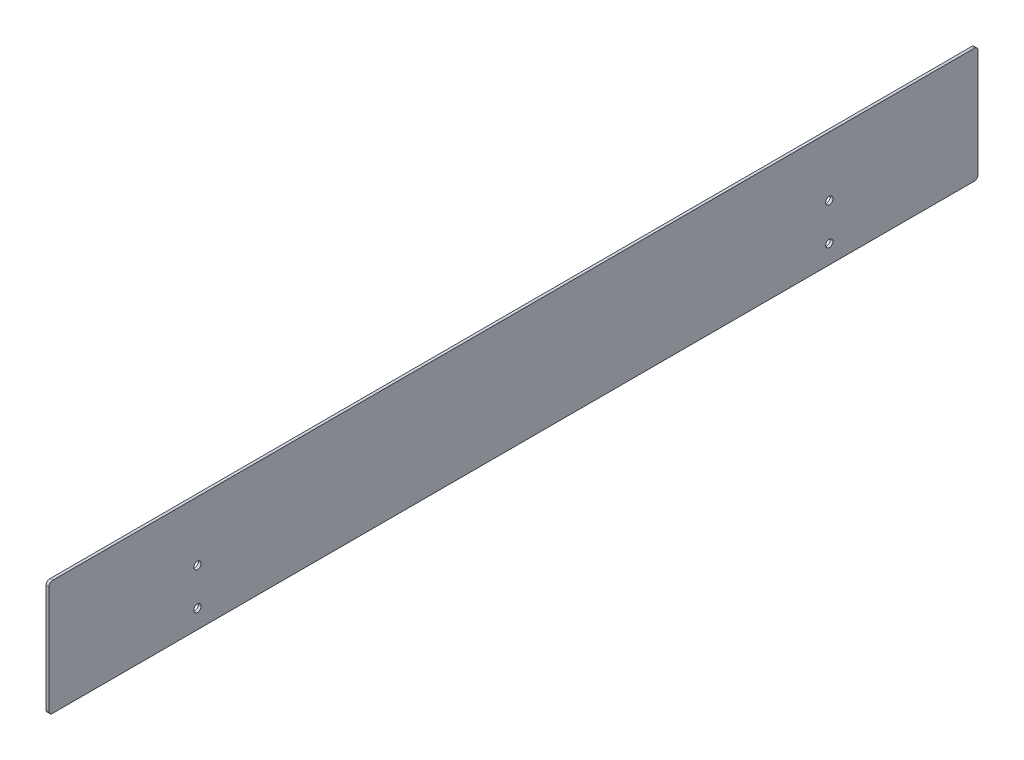
ISO-10303-21;
HEADER;
FILE_DESCRIPTION(('STEP AP214'),'2;1');
FILE_NAME('part.step','',(''),(''),'','','');
FILE_SCHEMA(('AUTOMOTIVE_DESIGN { 1 0 10303 214 1 1 1 1 }'));
ENDSEC;
DATA;
#1=APPLICATION_CONTEXT('core data for automotive mechanical design processes');
#2=APPLICATION_PROTOCOL_DEFINITION('international standard','automotive_design',2000,#1);
#3=PRODUCT_CONTEXT('',#1,'mechanical');
#4=PRODUCT('Part','Part','',(#3));
#5=PRODUCT_RELATED_PRODUCT_CATEGORY('part','',(#4));
#6=PRODUCT_DEFINITION_FORMATION('','',#4);
#7=PRODUCT_DEFINITION_CONTEXT('part definition',#1,'design');
#8=PRODUCT_DEFINITION('design','',#6,#7);
#9=PRODUCT_DEFINITION_SHAPE('','',#8);
#10=(LENGTH_UNIT() NAMED_UNIT(*) SI_UNIT(.MILLI.,.METRE.));
#11=(NAMED_UNIT(*) PLANE_ANGLE_UNIT() SI_UNIT($,.RADIAN.));
#12=(NAMED_UNIT(*) SI_UNIT($,.STERADIAN.) SOLID_ANGLE_UNIT());
#13=UNCERTAINTY_MEASURE_WITH_UNIT(LENGTH_MEASURE(1.E-05),#10,'distance_accuracy_value','');
#14=(GEOMETRIC_REPRESENTATION_CONTEXT(3) GLOBAL_UNCERTAINTY_ASSIGNED_CONTEXT((#13)) GLOBAL_UNIT_ASSIGNED_CONTEXT((#10,
#11,#12)) REPRESENTATION_CONTEXT('',''));
#15=CARTESIAN_POINT('',(0.,0.,0.));
#16=DIRECTION('',(0.,0.,1.));
#17=DIRECTION('',(1.,0.,0.));
#18=AXIS2_PLACEMENT_3D('',#15,#16,#17);
#19=CARTESIAN_POINT('',(1.5,0.,0.));
#20=DIRECTION('',(1.,0.,0.));
#21=DIRECTION('',(0.,0.,-1.));
#22=AXIS2_PLACEMENT_3D('',#19,#20,#21);
#23=PLANE('',#22);
#24=CARTESIAN_POINT('',(1.5,-110.292553191489,181.339345362168));
#25=DIRECTION('',(1.,0.,0.));
#26=DIRECTION('',(0.,0.,-1.));
#27=AXIS2_PLACEMENT_3D('',#24,#25,#26);
#28=CIRCLE('',#27,1.95);
#29=CARTESIAN_POINT('',(1.5,-110.292553191489,179.389345362168));
#30=VERTEX_POINT('',#29);
#31=EDGE_CURVE('E180',#30,#30,#28,.T.);
#32=ORIENTED_EDGE('',*,*,#31,.F.);
#33=EDGE_LOOP('',(#32));
#34=FACE_BOUND('',#33,.T.);
#35=CARTESIAN_POINT('',(1.5,-110.292553191489,-158.660654637832));
#36=DIRECTION('',(1.,0.,0.));
#37=DIRECTION('',(0.,0.,-1.));
#38=AXIS2_PLACEMENT_3D('',#35,#36,#37);
#39=CIRCLE('',#38,1.95);
#40=CARTESIAN_POINT('',(1.5,-110.292553191489,-160.610654637832));
#41=VERTEX_POINT('',#40);
#42=EDGE_CURVE('E163',#41,#41,#39,.T.);
#43=ORIENTED_EDGE('',*,*,#42,.F.);
#44=EDGE_LOOP('',(#43));
#45=FACE_BOUND('',#44,.T.);
#46=DIRECTION('',(0.,0.,-1.));
#47=VECTOR('',#46,1.);
#48=CARTESIAN_POINT('',(1.5,-140.292553191489,261.339345362168));
#49=LINE('',#48,#47);
#50=CARTESIAN_POINT('',(1.5,-140.292553191489,259.339345362168));
#51=VERTEX_POINT('',#50);
#52=CARTESIAN_POINT('',(1.5,-140.292553191489,-236.660654637832));
#53=VERTEX_POINT('',#52);
#54=EDGE_CURVE('E170',#51,#53,#49,.T.);
#55=ORIENTED_EDGE('',*,*,#54,.T.);
#56=CARTESIAN_POINT('',(1.5,-138.292553191489,-236.660654637832));
#57=DIRECTION('',(1.,0.,0.));
#58=DIRECTION('',(0.,0.,-1.));
#59=AXIS2_PLACEMENT_3D('',#56,#57,#58);
#60=CIRCLE('',#59,2.);
#61=CARTESIAN_POINT('',(1.5,-138.292553191489,-238.660654637832));
#62=VERTEX_POINT('',#61);
#63=EDGE_CURVE('E147',#53,#62,#60,.T.);
#64=ORIENTED_EDGE('',*,*,#63,.T.);
#65=DIRECTION('',(0.,1.,0.));
#66=VECTOR('',#65,1.);
#67=CARTESIAN_POINT('',(1.5,-78.2925531914894,-238.660654637832));
#68=LINE('',#67,#66);
#69=CARTESIAN_POINT('',(1.5,-80.2925531914894,-238.660654637832));
#70=VERTEX_POINT('',#69);
#71=EDGE_CURVE('E117',#62,#70,#68,.T.);
#72=ORIENTED_EDGE('',*,*,#71,.T.);
#73=CARTESIAN_POINT('',(1.5,-80.2925531914894,-236.660654637832));
#74=DIRECTION('',(1.,0.,0.));
#75=DIRECTION('',(0.,0.,-1.));
#76=AXIS2_PLACEMENT_3D('',#73,#74,#75);
#77=CIRCLE('',#76,2.);
#78=CARTESIAN_POINT('',(1.5,-78.2925531914894,-236.660654637832));
#79=VERTEX_POINT('',#78);
#80=EDGE_CURVE('E54',#70,#79,#77,.T.);
#81=ORIENTED_EDGE('',*,*,#80,.T.);
#82=DIRECTION('',(0.,0.,1.));
#83=VECTOR('',#82,1.);
#84=CARTESIAN_POINT('',(1.5,-78.2925531914894,261.339345362168));
#85=LINE('',#84,#83);
#86=CARTESIAN_POINT('',(1.5,-78.2925531914894,259.339345362168));
#87=VERTEX_POINT('',#86);
#88=EDGE_CURVE('E133',#79,#87,#85,.T.);
#89=ORIENTED_EDGE('',*,*,#88,.T.);
#90=CARTESIAN_POINT('',(1.5,-80.2925531914894,259.339345362168));
#91=DIRECTION('',(1.,0.,0.));
#92=DIRECTION('',(0.,0.,-1.));
#93=AXIS2_PLACEMENT_3D('',#90,#91,#92);
#94=CIRCLE('',#93,2.);
#95=CARTESIAN_POINT('',(1.5,-80.2925531914894,261.339345362168));
#96=VERTEX_POINT('',#95);
#97=EDGE_CURVE('E142',#87,#96,#94,.T.);
#98=ORIENTED_EDGE('',*,*,#97,.T.);
#99=DIRECTION('',(0.,-1.,0.));
#100=VECTOR('',#99,1.);
#101=CARTESIAN_POINT('',(1.5,-78.2925531914894,261.339345362168));
#102=LINE('',#101,#100);
#103=CARTESIAN_POINT('',(1.5,-138.292553191489,261.339345362168));
#104=VERTEX_POINT('',#103);
#105=EDGE_CURVE('E127',#96,#104,#102,.T.);
#106=ORIENTED_EDGE('',*,*,#105,.T.);
#107=CARTESIAN_POINT('',(1.5,-138.292553191489,259.339345362168));
#108=DIRECTION('',(1.,0.,0.));
#109=DIRECTION('',(0.,0.,-1.));
#110=AXIS2_PLACEMENT_3D('',#107,#108,#109);
#111=CIRCLE('',#110,2.);
#112=EDGE_CURVE('E144',#104,#51,#111,.T.);
#113=ORIENTED_EDGE('',*,*,#112,.T.);
#114=EDGE_LOOP('',(#55,#64,#72,#81,#89,#98,#106,#113));
#115=FACE_BOUND('',#114,.T.);
#116=CARTESIAN_POINT('',(1.5,-130.292553191489,-158.660654637832));
#117=DIRECTION('',(1.,0.,0.));
#118=DIRECTION('',(0.,0.,-1.));
#119=AXIS2_PLACEMENT_3D('',#116,#117,#118);
#120=CIRCLE('',#119,1.95);
#121=CARTESIAN_POINT('',(1.5,-130.292553191489,-160.610654637832));
#122=VERTEX_POINT('',#121);
#123=EDGE_CURVE('E175',#122,#122,#120,.T.);
#124=ORIENTED_EDGE('',*,*,#123,.F.);
#125=EDGE_LOOP('',(#124));
#126=FACE_BOUND('',#125,.T.);
#127=CARTESIAN_POINT('',(1.5,-130.292553191489,181.339345362168));
#128=DIRECTION('',(1.,0.,0.));
#129=DIRECTION('',(0.,0.,-1.));
#130=AXIS2_PLACEMENT_3D('',#127,#128,#129);
#131=CIRCLE('',#130,1.95);
#132=CARTESIAN_POINT('',(1.5,-130.292553191489,179.389345362168));
#133=VERTEX_POINT('',#132);
#134=EDGE_CURVE('E186',#133,#133,#131,.T.);
#135=ORIENTED_EDGE('',*,*,#134,.F.);
#136=EDGE_LOOP('',(#135));
#137=FACE_BOUND('',#136,.T.);
#138=ADVANCED_FACE('F32',(#34,#45,#115,#126,#137),#23,.T.);
#139=CARTESIAN_POINT('',(0.,0.,0.));
#140=DIRECTION('',(1.,0.,0.));
#141=DIRECTION('',(0.,0.,-1.));
#142=AXIS2_PLACEMENT_3D('',#139,#140,#141);
#143=PLANE('',#142);
#144=DIRECTION('',(0.,1.,0.));
#145=VECTOR('',#144,1.);
#146=CARTESIAN_POINT('',(0.,-78.2925531914894,-238.660654637832));
#147=LINE('',#146,#145);
#148=CARTESIAN_POINT('',(0.,-138.292553191489,-238.660654637832));
#149=VERTEX_POINT('',#148);
#150=CARTESIAN_POINT('',(0.,-80.2925531914894,-238.660654637832));
#151=VERTEX_POINT('',#150);
#152=EDGE_CURVE('E115',#149,#151,#147,.T.);
#153=ORIENTED_EDGE('',*,*,#152,.F.);
#154=CARTESIAN_POINT('',(0.,-138.292553191489,-236.660654637832));
#155=DIRECTION('',(1.,0.,0.));
#156=DIRECTION('',(0.,0.,-1.));
#157=AXIS2_PLACEMENT_3D('',#154,#155,#156);
#158=CIRCLE('',#157,2.);
#159=CARTESIAN_POINT('',(0.,-140.292553191489,-236.660654637832));
#160=VERTEX_POINT('',#159);
#161=EDGE_CURVE('E98',#149,#160,#158,.F.);
#162=ORIENTED_EDGE('',*,*,#161,.T.);
#163=DIRECTION('',(0.,0.,-1.));
#164=VECTOR('',#163,1.);
#165=CARTESIAN_POINT('',(0.,-140.292553191489,261.339345362168));
#166=LINE('',#165,#164);
#167=CARTESIAN_POINT('',(0.,-140.292553191489,259.339345362168));
#168=VERTEX_POINT('',#167);
#169=EDGE_CURVE('E125',#168,#160,#166,.T.);
#170=ORIENTED_EDGE('',*,*,#169,.F.);
#171=CARTESIAN_POINT('',(0.,-138.292553191489,259.339345362168));
#172=DIRECTION('',(1.,0.,0.));
#173=DIRECTION('',(0.,0.,-1.));
#174=AXIS2_PLACEMENT_3D('',#171,#172,#173);
#175=CIRCLE('',#174,2.);
#176=CARTESIAN_POINT('',(0.,-138.292553191489,261.339345362168));
#177=VERTEX_POINT('',#176);
#178=EDGE_CURVE('E136',#168,#177,#175,.F.);
#179=ORIENTED_EDGE('',*,*,#178,.T.);
#180=DIRECTION('',(0.,-1.,0.));
#181=VECTOR('',#180,1.);
#182=CARTESIAN_POINT('',(0.,-78.2925531914894,261.339345362168));
#183=LINE('',#182,#181);
#184=CARTESIAN_POINT('',(0.,-80.2925531914894,261.339345362168));
#185=VERTEX_POINT('',#184);
#186=EDGE_CURVE('E129',#185,#177,#183,.T.);
#187=ORIENTED_EDGE('',*,*,#186,.F.);
#188=CARTESIAN_POINT('',(0.,-80.2925531914894,259.339345362168));
#189=DIRECTION('',(1.,0.,0.));
#190=DIRECTION('',(0.,0.,-1.));
#191=AXIS2_PLACEMENT_3D('',#188,#189,#190);
#192=CIRCLE('',#191,2.);
#193=CARTESIAN_POINT('',(0.,-78.2925531914894,259.339345362168));
#194=VERTEX_POINT('',#193);
#195=EDGE_CURVE('E118',#185,#194,#192,.F.);
#196=ORIENTED_EDGE('',*,*,#195,.T.);
#197=DIRECTION('',(0.,0.,1.));
#198=VECTOR('',#197,1.);
#199=CARTESIAN_POINT('',(0.,-78.2925531914894,261.339345362168));
#200=LINE('',#199,#198);
#201=CARTESIAN_POINT('',(0.,-78.2925531914894,-236.660654637832));
#202=VERTEX_POINT('',#201);
#203=EDGE_CURVE('E124',#202,#194,#200,.T.);
#204=ORIENTED_EDGE('',*,*,#203,.F.);
#205=CARTESIAN_POINT('',(0.,-80.2925531914894,-236.660654637832));
#206=DIRECTION('',(1.,0.,0.));
#207=DIRECTION('',(0.,0.,-1.));
#208=AXIS2_PLACEMENT_3D('',#205,#206,#207);
#209=CIRCLE('',#208,2.);
#210=EDGE_CURVE('E109',#202,#151,#209,.F.);
#211=ORIENTED_EDGE('',*,*,#210,.T.);
#212=EDGE_LOOP('',(#153,#162,#170,#179,#187,#196,#204,#211));
#213=FACE_BOUND('',#212,.T.);
#214=CARTESIAN_POINT('',(0.,-110.292553191489,-158.660654637832));
#215=DIRECTION('',(1.,0.,0.));
#216=DIRECTION('',(0.,0.,-1.));
#217=AXIS2_PLACEMENT_3D('',#214,#215,#216);
#218=CIRCLE('',#217,1.95);
#219=CARTESIAN_POINT('',(0.,-110.292553191489,-160.610654637832));
#220=VERTEX_POINT('',#219);
#221=EDGE_CURVE('E165',#220,#220,#218,.T.);
#222=ORIENTED_EDGE('',*,*,#221,.T.);
#223=EDGE_LOOP('',(#222));
#224=FACE_BOUND('',#223,.T.);
#225=CARTESIAN_POINT('',(0.,-130.292553191489,-158.660654637832));
#226=DIRECTION('',(1.,0.,0.));
#227=DIRECTION('',(0.,0.,-1.));
#228=AXIS2_PLACEMENT_3D('',#225,#226,#227);
#229=CIRCLE('',#228,1.95);
#230=CARTESIAN_POINT('',(0.,-130.292553191489,-160.610654637832));
#231=VERTEX_POINT('',#230);
#232=EDGE_CURVE('E177',#231,#231,#229,.T.);
#233=ORIENTED_EDGE('',*,*,#232,.T.);
#234=EDGE_LOOP('',(#233));
#235=FACE_BOUND('',#234,.T.);
#236=CARTESIAN_POINT('',(0.,-110.292553191489,181.339345362168));
#237=DIRECTION('',(1.,0.,0.));
#238=DIRECTION('',(0.,0.,-1.));
#239=AXIS2_PLACEMENT_3D('',#236,#237,#238);
#240=CIRCLE('',#239,1.95);
#241=CARTESIAN_POINT('',(0.,-110.292553191489,179.389345362168));
#242=VERTEX_POINT('',#241);
#243=EDGE_CURVE('E183',#242,#242,#240,.T.);
#244=ORIENTED_EDGE('',*,*,#243,.T.);
#245=EDGE_LOOP('',(#244));
#246=FACE_BOUND('',#245,.T.);
#247=CARTESIAN_POINT('',(0.,-130.292553191489,181.339345362168));
#248=DIRECTION('',(1.,0.,0.));
#249=DIRECTION('',(0.,0.,-1.));
#250=AXIS2_PLACEMENT_3D('',#247,#248,#249);
#251=CIRCLE('',#250,1.95);
#252=CARTESIAN_POINT('',(0.,-130.292553191489,179.389345362168));
#253=VERTEX_POINT('',#252);
#254=EDGE_CURVE('E189',#253,#253,#251,.T.);
#255=ORIENTED_EDGE('',*,*,#254,.T.);
#256=EDGE_LOOP('',(#255));
#257=FACE_BOUND('',#256,.T.);
#258=ADVANCED_FACE('F121',(#213,#224,#235,#246,#257),#143,.F.);
#259=CARTESIAN_POINT('',(1.5,-78.2925531914894,261.339345362168));
#260=DIRECTION('',(0.,0.,-1.));
#261=DIRECTION('',(0.,1.,0.));
#262=AXIS2_PLACEMENT_3D('',#259,#260,#261);
#263=PLANE('',#262);
#264=ORIENTED_EDGE('',*,*,#186,.T.);
#265=DIRECTION('',(-1.,0.,0.));
#266=VECTOR('',#265,1.);
#267=CARTESIAN_POINT('',(1.5,-138.292553191489,261.339345362168));
#268=LINE('',#267,#266);
#269=EDGE_CURVE('E11',#177,#104,#268,.F.);
#270=ORIENTED_EDGE('',*,*,#269,.T.);
#271=ORIENTED_EDGE('',*,*,#105,.F.);
#272=DIRECTION('',(-1.,0.,0.));
#273=VECTOR('',#272,1.);
#274=CARTESIAN_POINT('',(1.5,-80.2925531914894,261.339345362168));
#275=LINE('',#274,#273);
#276=EDGE_CURVE('E40',#96,#185,#275,.T.);
#277=ORIENTED_EDGE('',*,*,#276,.T.);
#278=EDGE_LOOP('',(#264,#270,#271,#277));
#279=FACE_BOUND('',#278,.T.);
#280=ADVANCED_FACE('F158',(#279),#263,.F.);
#281=CARTESIAN_POINT('',(1.5,-140.292553191489,261.339345362168));
#282=DIRECTION('',(0.,1.,0.));
#283=DIRECTION('',(0.,0.,1.));
#284=AXIS2_PLACEMENT_3D('',#281,#282,#283);
#285=PLANE('',#284);
#286=ORIENTED_EDGE('',*,*,#169,.T.);
#287=DIRECTION('',(-1.,0.,0.));
#288=VECTOR('',#287,1.);
#289=CARTESIAN_POINT('',(1.5,-140.292553191489,-236.660654637832));
#290=LINE('',#289,#288);
#291=EDGE_CURVE('E103',#160,#53,#290,.F.);
#292=ORIENTED_EDGE('',*,*,#291,.T.);
#293=ORIENTED_EDGE('',*,*,#54,.F.);
#294=DIRECTION('',(-1.,0.,0.));
#295=VECTOR('',#294,1.);
#296=CARTESIAN_POINT('',(1.5,-140.292553191489,259.339345362168));
#297=LINE('',#296,#295);
#298=EDGE_CURVE('E108',#51,#168,#297,.T.);
#299=ORIENTED_EDGE('',*,*,#298,.T.);
#300=EDGE_LOOP('',(#286,#292,#293,#299));
#301=FACE_BOUND('',#300,.T.);
#302=ADVANCED_FACE('F216',(#301),#285,.F.);
#303=CARTESIAN_POINT('',(1.5,-78.2925531914894,-238.660654637832));
#304=DIRECTION('',(0.,0.,1.));
#305=DIRECTION('',(0.,-1.,0.));
#306=AXIS2_PLACEMENT_3D('',#303,#304,#305);
#307=PLANE('',#306);
#308=ORIENTED_EDGE('',*,*,#71,.F.);
#309=DIRECTION('',(-1.,0.,0.));
#310=VECTOR('',#309,1.);
#311=CARTESIAN_POINT('',(1.5,-138.292553191489,-238.660654637832));
#312=LINE('',#311,#310);
#313=EDGE_CURVE('E102',#62,#149,#312,.T.);
#314=ORIENTED_EDGE('',*,*,#313,.T.);
#315=ORIENTED_EDGE('',*,*,#152,.T.);
#316=DIRECTION('',(-1.,0.,0.));
#317=VECTOR('',#316,1.);
#318=CARTESIAN_POINT('',(1.5,-80.2925531914894,-238.660654637832));
#319=LINE('',#318,#317);
#320=EDGE_CURVE('E119',#151,#70,#319,.F.);
#321=ORIENTED_EDGE('',*,*,#320,.T.);
#322=EDGE_LOOP('',(#308,#314,#315,#321));
#323=FACE_BOUND('',#322,.T.);
#324=ADVANCED_FACE('F114',(#323),#307,.F.);
#325=CARTESIAN_POINT('',(1.5,-78.2925531914894,261.339345362168));
#326=DIRECTION('',(0.,-1.,0.));
#327=DIRECTION('',(0.,0.,-1.));
#328=AXIS2_PLACEMENT_3D('',#325,#326,#327);
#329=PLANE('',#328);
#330=ORIENTED_EDGE('',*,*,#88,.F.);
#331=DIRECTION('',(-1.,0.,0.));
#332=VECTOR('',#331,1.);
#333=CARTESIAN_POINT('',(1.5,-78.2925531914894,-236.660654637832));
#334=LINE('',#333,#332);
#335=EDGE_CURVE('E150',#79,#202,#334,.T.);
#336=ORIENTED_EDGE('',*,*,#335,.T.);
#337=ORIENTED_EDGE('',*,*,#203,.T.);
#338=DIRECTION('',(-1.,0.,0.));
#339=VECTOR('',#338,1.);
#340=CARTESIAN_POINT('',(1.5,-78.2925531914894,259.339345362168));
#341=LINE('',#340,#339);
#342=EDGE_CURVE('E47',#194,#87,#341,.F.);
#343=ORIENTED_EDGE('',*,*,#342,.T.);
#344=EDGE_LOOP('',(#330,#336,#337,#343));
#345=FACE_BOUND('',#344,.T.);
#346=ADVANCED_FACE('F211',(#345),#329,.F.);
#347=CARTESIAN_POINT('',(1.5,-110.292553191489,-158.660654637832));
#348=DIRECTION('',(-1.,0.,0.));
#349=DIRECTION('',(0.,0.,1.));
#350=AXIS2_PLACEMENT_3D('',#347,#348,#349);
#351=CYLINDRICAL_SURFACE('',#350,1.95);
#352=ORIENTED_EDGE('',*,*,#42,.T.);
#353=EDGE_LOOP('',(#352));
#354=FACE_BOUND('',#353,.T.);
#355=ORIENTED_EDGE('',*,*,#221,.F.);
#356=EDGE_LOOP('',(#355));
#357=FACE_BOUND('',#356,.T.);
#358=ADVANCED_FACE('F208',(#354,#357),#351,.F.);
#359=CARTESIAN_POINT('',(1.5,-130.292553191489,-158.660654637832));
#360=DIRECTION('',(-1.,0.,0.));
#361=DIRECTION('',(0.,0.,1.));
#362=AXIS2_PLACEMENT_3D('',#359,#360,#361);
#363=CYLINDRICAL_SURFACE('',#362,1.95);
#364=ORIENTED_EDGE('',*,*,#123,.T.);
#365=EDGE_LOOP('',(#364));
#366=FACE_BOUND('',#365,.T.);
#367=ORIENTED_EDGE('',*,*,#232,.F.);
#368=EDGE_LOOP('',(#367));
#369=FACE_BOUND('',#368,.T.);
#370=ADVANCED_FACE('F240',(#366,#369),#363,.F.);
#371=CARTESIAN_POINT('',(1.5,-110.292553191489,181.339345362168));
#372=DIRECTION('',(-1.,0.,0.));
#373=DIRECTION('',(0.,0.,1.));
#374=AXIS2_PLACEMENT_3D('',#371,#372,#373);
#375=CYLINDRICAL_SURFACE('',#374,1.95);
#376=ORIENTED_EDGE('',*,*,#31,.T.);
#377=EDGE_LOOP('',(#376));
#378=FACE_BOUND('',#377,.T.);
#379=ORIENTED_EDGE('',*,*,#243,.F.);
#380=EDGE_LOOP('',(#379));
#381=FACE_BOUND('',#380,.T.);
#382=ADVANCED_FACE('F243',(#378,#381),#375,.F.);
#383=CARTESIAN_POINT('',(1.5,-130.292553191489,181.339345362168));
#384=DIRECTION('',(-1.,0.,0.));
#385=DIRECTION('',(0.,0.,1.));
#386=AXIS2_PLACEMENT_3D('',#383,#384,#385);
#387=CYLINDRICAL_SURFACE('',#386,1.95);
#388=ORIENTED_EDGE('',*,*,#134,.T.);
#389=EDGE_LOOP('',(#388));
#390=FACE_BOUND('',#389,.T.);
#391=ORIENTED_EDGE('',*,*,#254,.F.);
#392=EDGE_LOOP('',(#391));
#393=FACE_BOUND('',#392,.T.);
#394=ADVANCED_FACE('F195',(#390,#393),#387,.F.);
#395=CARTESIAN_POINT('',(1.5,-138.292553191489,-236.660654637832));
#396=DIRECTION('',(-1.,0.,0.));
#397=DIRECTION('',(0.,0.,1.));
#398=AXIS2_PLACEMENT_3D('',#395,#396,#397);
#399=CYLINDRICAL_SURFACE('',#398,2.);
#400=ORIENTED_EDGE('',*,*,#63,.F.);
#401=ORIENTED_EDGE('',*,*,#291,.F.);
#402=ORIENTED_EDGE('',*,*,#161,.F.);
#403=ORIENTED_EDGE('',*,*,#313,.F.);
#404=EDGE_LOOP('',(#400,#401,#402,#403));
#405=FACE_BOUND('',#404,.T.);
#406=ADVANCED_FACE('F101',(#405),#399,.T.);
#407=CARTESIAN_POINT('',(1.5,-80.2925531914894,-236.660654637832));
#408=DIRECTION('',(-1.,0.,0.));
#409=DIRECTION('',(0.,0.,1.));
#410=AXIS2_PLACEMENT_3D('',#407,#408,#409);
#411=CYLINDRICAL_SURFACE('',#410,2.);
#412=ORIENTED_EDGE('',*,*,#80,.F.);
#413=ORIENTED_EDGE('',*,*,#320,.F.);
#414=ORIENTED_EDGE('',*,*,#210,.F.);
#415=ORIENTED_EDGE('',*,*,#335,.F.);
#416=EDGE_LOOP('',(#412,#413,#414,#415));
#417=FACE_BOUND('',#416,.T.);
#418=ADVANCED_FACE('F224',(#417),#411,.T.);
#419=CARTESIAN_POINT('',(1.5,-138.292553191489,259.339345362168));
#420=DIRECTION('',(-1.,0.,0.));
#421=DIRECTION('',(0.,0.,1.));
#422=AXIS2_PLACEMENT_3D('',#419,#420,#421);
#423=CYLINDRICAL_SURFACE('',#422,2.);
#424=ORIENTED_EDGE('',*,*,#112,.F.);
#425=ORIENTED_EDGE('',*,*,#269,.F.);
#426=ORIENTED_EDGE('',*,*,#178,.F.);
#427=ORIENTED_EDGE('',*,*,#298,.F.);
#428=EDGE_LOOP('',(#424,#425,#426,#427));
#429=FACE_BOUND('',#428,.T.);
#430=ADVANCED_FACE('F226',(#429),#423,.T.);
#431=CARTESIAN_POINT('',(1.5,-80.2925531914894,259.339345362168));
#432=DIRECTION('',(-1.,0.,0.));
#433=DIRECTION('',(0.,0.,1.));
#434=AXIS2_PLACEMENT_3D('',#431,#432,#433);
#435=CYLINDRICAL_SURFACE('',#434,2.);
#436=ORIENTED_EDGE('',*,*,#97,.F.);
#437=ORIENTED_EDGE('',*,*,#342,.F.);
#438=ORIENTED_EDGE('',*,*,#195,.F.);
#439=ORIENTED_EDGE('',*,*,#276,.F.);
#440=EDGE_LOOP('',(#436,#437,#438,#439));
#441=FACE_BOUND('',#440,.T.);
#442=ADVANCED_FACE('F34',(#441),#435,.T.);
#443=CLOSED_SHELL('',(#138,#258,#280,#302,#324,#346,#358,#370,#382,#394,#406,#418,#430,#442));
#444=MANIFOLD_SOLID_BREP('B2',#443);
#445=ADVANCED_BREP_SHAPE_REPRESENTATION('',(#18,#444),#14);
#446=SHAPE_DEFINITION_REPRESENTATION(#9,#445);
ENDSEC;
END-ISO-10303-21;
